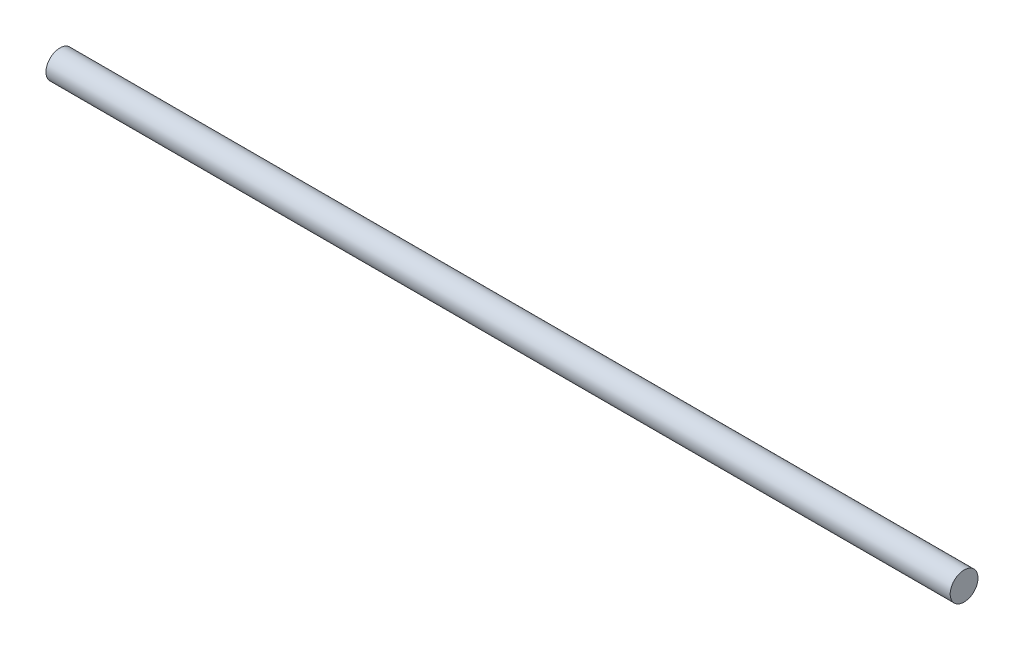
ISO-10303-21;
HEADER;
FILE_DESCRIPTION(('STEP AP214'),'2;1');
FILE_NAME('part.step','',(''),(''),'','','');
FILE_SCHEMA(('AUTOMOTIVE_DESIGN { 1 0 10303 214 1 1 1 1 }'));
ENDSEC;
DATA;
#1=APPLICATION_CONTEXT('core data for automotive mechanical design processes');
#2=APPLICATION_PROTOCOL_DEFINITION('international standard','automotive_design',2000,#1);
#3=PRODUCT_CONTEXT('',#1,'mechanical');
#4=PRODUCT('Part','Part','',(#3));
#5=PRODUCT_RELATED_PRODUCT_CATEGORY('part','',(#4));
#6=PRODUCT_DEFINITION_FORMATION('','',#4);
#7=PRODUCT_DEFINITION_CONTEXT('part definition',#1,'design');
#8=PRODUCT_DEFINITION('design','',#6,#7);
#9=PRODUCT_DEFINITION_SHAPE('','',#8);
#10=(LENGTH_UNIT() NAMED_UNIT(*) SI_UNIT(.MILLI.,.METRE.));
#11=(NAMED_UNIT(*) PLANE_ANGLE_UNIT() SI_UNIT($,.RADIAN.));
#12=(NAMED_UNIT(*) SI_UNIT($,.STERADIAN.) SOLID_ANGLE_UNIT());
#13=UNCERTAINTY_MEASURE_WITH_UNIT(LENGTH_MEASURE(1.E-05),#10,'distance_accuracy_value','');
#14=(GEOMETRIC_REPRESENTATION_CONTEXT(3) GLOBAL_UNCERTAINTY_ASSIGNED_CONTEXT((#13)) GLOBAL_UNIT_ASSIGNED_CONTEXT((#10,
#11,#12)) REPRESENTATION_CONTEXT('',''));
#15=CARTESIAN_POINT('',(0.,0.,0.));
#16=DIRECTION('',(0.,0.,1.));
#17=DIRECTION('',(1.,0.,0.));
#18=AXIS2_PLACEMENT_3D('',#15,#16,#17);
#19=CARTESIAN_POINT('',(32.5,0.,0.));
#20=DIRECTION('',(-1.,0.,0.));
#21=DIRECTION('',(0.,0.,1.));
#22=AXIS2_PLACEMENT_3D('',#19,#20,#21);
#23=CYLINDRICAL_SURFACE('',#22,1.);
#24=CARTESIAN_POINT('',(32.5,0.,0.));
#25=DIRECTION('',(1.,0.,0.));
#26=DIRECTION('',(0.,0.,-1.));
#27=AXIS2_PLACEMENT_3D('',#24,#25,#26);
#28=CIRCLE('',#27,1.);
#29=CARTESIAN_POINT('',(32.5,0.,-1.));
#30=VERTEX_POINT('',#29);
#31=EDGE_CURVE('E10',#30,#30,#28,.T.);
#32=ORIENTED_EDGE('',*,*,#31,.F.);
#33=EDGE_LOOP('',(#32));
#34=FACE_BOUND('',#33,.T.);
#35=CARTESIAN_POINT('',(-32.5,0.,0.));
#36=DIRECTION('',(1.,0.,0.));
#37=DIRECTION('',(0.,0.,-1.));
#38=AXIS2_PLACEMENT_3D('',#35,#36,#37);
#39=CIRCLE('',#38,1.);
#40=CARTESIAN_POINT('',(-32.5,0.,-1.));
#41=VERTEX_POINT('',#40);
#42=EDGE_CURVE('E34',#41,#41,#39,.T.);
#43=ORIENTED_EDGE('',*,*,#42,.T.);
#44=EDGE_LOOP('',(#43));
#45=FACE_BOUND('',#44,.T.);
#46=ADVANCED_FACE('F31',(#34,#45),#23,.T.);
#47=CARTESIAN_POINT('',(32.5,0.,0.));
#48=DIRECTION('',(1.,0.,0.));
#49=DIRECTION('',(0.,0.,-1.));
#50=AXIS2_PLACEMENT_3D('',#47,#48,#49);
#51=PLANE('',#50);
#52=ORIENTED_EDGE('',*,*,#31,.T.);
#53=EDGE_LOOP('',(#52));
#54=FACE_BOUND('',#53,.T.);
#55=ADVANCED_FACE('F46',(#54),#51,.T.);
#56=CARTESIAN_POINT('',(-32.5,0.,0.));
#57=DIRECTION('',(1.,0.,0.));
#58=DIRECTION('',(0.,0.,-1.));
#59=AXIS2_PLACEMENT_3D('',#56,#57,#58);
#60=PLANE('',#59);
#61=ORIENTED_EDGE('',*,*,#42,.F.);
#62=EDGE_LOOP('',(#61));
#63=FACE_BOUND('',#62,.T.);
#64=ADVANCED_FACE('F44',(#63),#60,.F.);
#65=CLOSED_SHELL('',(#46,#55,#64));
#66=MANIFOLD_SOLID_BREP('B2',#65);
#67=ADVANCED_BREP_SHAPE_REPRESENTATION('',(#18,#66),#14);
#68=SHAPE_DEFINITION_REPRESENTATION(#9,#67);
ENDSEC;
END-ISO-10303-21;
